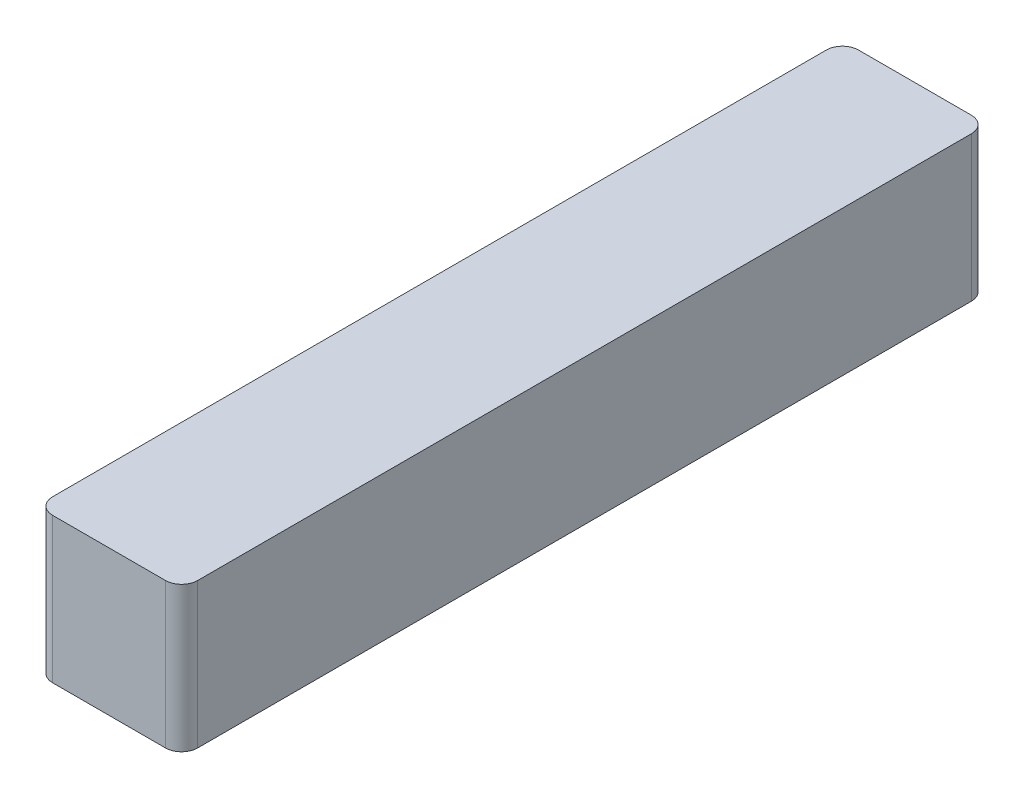
ISO-10303-21;
HEADER;
FILE_DESCRIPTION(('STEP AP214'),'2;1');
FILE_NAME('part.step','',(''),(''),'','','');
FILE_SCHEMA(('AUTOMOTIVE_DESIGN { 1 0 10303 214 1 1 1 1 }'));
ENDSEC;
DATA;
#1=APPLICATION_CONTEXT('core data for automotive mechanical design processes');
#2=APPLICATION_PROTOCOL_DEFINITION('international standard','automotive_design',2000,#1);
#3=PRODUCT_CONTEXT('',#1,'mechanical');
#4=PRODUCT('Part','Part','',(#3));
#5=PRODUCT_RELATED_PRODUCT_CATEGORY('part','',(#4));
#6=PRODUCT_DEFINITION_FORMATION('','',#4);
#7=PRODUCT_DEFINITION_CONTEXT('part definition',#1,'design');
#8=PRODUCT_DEFINITION('design','',#6,#7);
#9=PRODUCT_DEFINITION_SHAPE('','',#8);
#10=(LENGTH_UNIT() NAMED_UNIT(*) SI_UNIT(.MILLI.,.METRE.));
#11=(NAMED_UNIT(*) PLANE_ANGLE_UNIT() SI_UNIT($,.RADIAN.));
#12=(NAMED_UNIT(*) SI_UNIT($,.STERADIAN.) SOLID_ANGLE_UNIT());
#13=UNCERTAINTY_MEASURE_WITH_UNIT(LENGTH_MEASURE(1.E-05),#10,'distance_accuracy_value','');
#14=(GEOMETRIC_REPRESENTATION_CONTEXT(3) GLOBAL_UNCERTAINTY_ASSIGNED_CONTEXT((#13)) GLOBAL_UNIT_ASSIGNED_CONTEXT((#10,
#11,#12)) REPRESENTATION_CONTEXT('',''));
#15=CARTESIAN_POINT('',(0.,0.,0.));
#16=DIRECTION('',(0.,0.,1.));
#17=DIRECTION('',(1.,0.,0.));
#18=AXIS2_PLACEMENT_3D('',#15,#16,#17);
#19=CARTESIAN_POINT('',(1.143,1.143,12.7));
#20=DIRECTION('',(-1.,0.,0.));
#21=DIRECTION('',(0.,-1.,0.));
#22=AXIS2_PLACEMENT_3D('',#19,#20,#21);
#23=PLANE('',#22);
#24=DIRECTION('',(0.,0.,-1.));
#25=VECTOR('',#24,1.);
#26=CARTESIAN_POINT('',(1.143,-1.143,12.7));
#27=LINE('',#26,#25);
#28=CARTESIAN_POINT('',(1.143,-1.143,12.446));
#29=VERTEX_POINT('',#28);
#30=CARTESIAN_POINT('',(1.143,-1.143,0.254000000000001));
#31=VERTEX_POINT('',#30);
#32=EDGE_CURVE('E121',#29,#31,#27,.T.);
#33=ORIENTED_EDGE('',*,*,#32,.T.);
#34=DIRECTION('',(0.,1.,0.));
#35=VECTOR('',#34,1.);
#36=CARTESIAN_POINT('',(1.143,1.143,0.254000000000001));
#37=LINE('',#36,#35);
#38=CARTESIAN_POINT('',(1.143,1.143,0.254000000000001));
#39=VERTEX_POINT('',#38);
#40=EDGE_CURVE('E147',#31,#39,#37,.T.);
#41=ORIENTED_EDGE('',*,*,#40,.T.);
#42=DIRECTION('',(0.,0.,-1.));
#43=VECTOR('',#42,1.);
#44=CARTESIAN_POINT('',(1.143,1.143,12.7));
#45=LINE('',#44,#43);
#46=CARTESIAN_POINT('',(1.143,1.143,12.446));
#47=VERTEX_POINT('',#46);
#48=EDGE_CURVE('E125',#47,#39,#45,.T.);
#49=ORIENTED_EDGE('',*,*,#48,.F.);
#50=DIRECTION('',(0.,1.,0.));
#51=VECTOR('',#50,1.);
#52=CARTESIAN_POINT('',(1.143,-1.143,12.446));
#53=LINE('',#52,#51);
#54=EDGE_CURVE('E145',#47,#29,#53,.F.);
#55=ORIENTED_EDGE('',*,*,#54,.T.);
#56=EDGE_LOOP('',(#33,#41,#49,#55));
#57=FACE_BOUND('',#56,.T.);
#58=ADVANCED_FACE('F33',(#57),#23,.F.);
#59=CARTESIAN_POINT('',(-1.143,1.143,12.7));
#60=DIRECTION('',(0.,-1.,0.));
#61=DIRECTION('',(0.,0.,-1.));
#62=AXIS2_PLACEMENT_3D('',#59,#60,#61);
#63=PLANE('',#62);
#64=DIRECTION('',(-1.,0.,0.));
#65=VECTOR('',#64,1.);
#66=CARTESIAN_POINT('',(-1.143,1.143,0.));
#67=LINE('',#66,#65);
#68=CARTESIAN_POINT('',(0.889,1.143,0.));
#69=VERTEX_POINT('',#68);
#70=CARTESIAN_POINT('',(-0.889,1.143,0.));
#71=VERTEX_POINT('',#70);
#72=EDGE_CURVE('E157',#69,#71,#67,.T.);
#73=ORIENTED_EDGE('',*,*,#72,.T.);
#74=CARTESIAN_POINT('',(-0.889,1.143,0.254000000000001));
#75=DIRECTION('',(0.,-1.,0.));
#76=DIRECTION('',(0.,0.,-1.));
#77=AXIS2_PLACEMENT_3D('',#74,#75,#76);
#78=CIRCLE('',#77,0.254);
#79=CARTESIAN_POINT('',(-1.143,1.143,0.254000000000001));
#80=VERTEX_POINT('',#79);
#81=EDGE_CURVE('E143',#71,#80,#78,.F.);
#82=ORIENTED_EDGE('',*,*,#81,.T.);
#83=DIRECTION('',(0.,0.,-1.));
#84=VECTOR('',#83,1.);
#85=CARTESIAN_POINT('',(-1.143,1.143,12.7));
#86=LINE('',#85,#84);
#87=CARTESIAN_POINT('',(-1.143,1.143,12.446));
#88=VERTEX_POINT('',#87);
#89=EDGE_CURVE('E120',#88,#80,#86,.T.);
#90=ORIENTED_EDGE('',*,*,#89,.F.);
#91=CARTESIAN_POINT('',(-0.889,1.143,12.446));
#92=DIRECTION('',(0.,-1.,0.));
#93=DIRECTION('',(0.,0.,-1.));
#94=AXIS2_PLACEMENT_3D('',#91,#92,#93);
#95=CIRCLE('',#94,0.254);
#96=CARTESIAN_POINT('',(-0.889,1.143,12.7));
#97=VERTEX_POINT('',#96);
#98=EDGE_CURVE('E124',#88,#97,#95,.F.);
#99=ORIENTED_EDGE('',*,*,#98,.T.);
#100=DIRECTION('',(-1.,0.,0.));
#101=VECTOR('',#100,1.);
#102=CARTESIAN_POINT('',(-1.143,1.143,12.7));
#103=LINE('',#102,#101);
#104=CARTESIAN_POINT('',(0.889,1.143,12.7));
#105=VERTEX_POINT('',#104);
#106=EDGE_CURVE('E152',#105,#97,#103,.T.);
#107=ORIENTED_EDGE('',*,*,#106,.F.);
#108=CARTESIAN_POINT('',(0.888999999999999,1.143,12.446));
#109=DIRECTION('',(0.,-1.,0.));
#110=DIRECTION('',(0.,0.,-1.));
#111=AXIS2_PLACEMENT_3D('',#108,#109,#110);
#112=CIRCLE('',#111,0.254);
#113=EDGE_CURVE('E56',#105,#47,#112,.F.);
#114=ORIENTED_EDGE('',*,*,#113,.T.);
#115=ORIENTED_EDGE('',*,*,#48,.T.);
#116=CARTESIAN_POINT('',(0.888999999999999,1.143,0.254000000000001));
#117=DIRECTION('',(0.,-1.,0.));
#118=DIRECTION('',(0.,0.,-1.));
#119=AXIS2_PLACEMENT_3D('',#116,#117,#118);
#120=CIRCLE('',#119,0.254);
#121=EDGE_CURVE('E48',#39,#69,#120,.F.);
#122=ORIENTED_EDGE('',*,*,#121,.T.);
#123=EDGE_LOOP('',(#73,#82,#90,#99,#107,#114,#115,#122));
#124=FACE_BOUND('',#123,.T.);
#125=ADVANCED_FACE('F186',(#124),#63,.F.);
#126=CARTESIAN_POINT('',(-1.143,1.143,12.7));
#127=DIRECTION('',(1.,0.,0.));
#128=DIRECTION('',(0.,1.,0.));
#129=AXIS2_PLACEMENT_3D('',#126,#127,#128);
#130=PLANE('',#129);
#131=ORIENTED_EDGE('',*,*,#89,.T.);
#132=DIRECTION('',(0.,-1.,0.));
#133=VECTOR('',#132,1.);
#134=CARTESIAN_POINT('',(-1.143,1.143,0.254000000000001));
#135=LINE('',#134,#133);
#136=CARTESIAN_POINT('',(-1.143,-1.143,0.254000000000001));
#137=VERTEX_POINT('',#136);
#138=EDGE_CURVE('E111',#80,#137,#135,.T.);
#139=ORIENTED_EDGE('',*,*,#138,.T.);
#140=DIRECTION('',(0.,0.,-1.));
#141=VECTOR('',#140,1.);
#142=CARTESIAN_POINT('',(-1.143,-1.143,12.7));
#143=LINE('',#142,#141);
#144=CARTESIAN_POINT('',(-1.143,-1.143,12.446));
#145=VERTEX_POINT('',#144);
#146=EDGE_CURVE('E103',#145,#137,#143,.T.);
#147=ORIENTED_EDGE('',*,*,#146,.F.);
#148=DIRECTION('',(0.,-1.,0.));
#149=VECTOR('',#148,1.);
#150=CARTESIAN_POINT('',(-1.143,1.143,12.446));
#151=LINE('',#150,#149);
#152=EDGE_CURVE('E117',#145,#88,#151,.F.);
#153=ORIENTED_EDGE('',*,*,#152,.T.);
#154=EDGE_LOOP('',(#131,#139,#147,#153));
#155=FACE_BOUND('',#154,.T.);
#156=ADVANCED_FACE('F116',(#155),#130,.F.);
#157=CARTESIAN_POINT('',(-1.143,-1.143,12.7));
#158=DIRECTION('',(0.,1.,0.));
#159=DIRECTION('',(0.,0.,1.));
#160=AXIS2_PLACEMENT_3D('',#157,#158,#159);
#161=PLANE('',#160);
#162=ORIENTED_EDGE('',*,*,#146,.T.);
#163=CARTESIAN_POINT('',(-0.889,-1.143,0.254000000000001));
#164=DIRECTION('',(0.,1.,0.));
#165=DIRECTION('',(0.,0.,1.));
#166=AXIS2_PLACEMENT_3D('',#163,#164,#165);
#167=CIRCLE('',#166,0.254);
#168=CARTESIAN_POINT('',(-0.889,-1.143,0.));
#169=VERTEX_POINT('',#168);
#170=EDGE_CURVE('E134',#137,#169,#167,.F.);
#171=ORIENTED_EDGE('',*,*,#170,.T.);
#172=DIRECTION('',(1.,0.,0.));
#173=VECTOR('',#172,1.);
#174=CARTESIAN_POINT('',(-1.143,-1.143,0.));
#175=LINE('',#174,#173);
#176=CARTESIAN_POINT('',(0.889,-1.143,0.));
#177=VERTEX_POINT('',#176);
#178=EDGE_CURVE('E153',#169,#177,#175,.T.);
#179=ORIENTED_EDGE('',*,*,#178,.T.);
#180=CARTESIAN_POINT('',(0.889,-1.143,0.254000000000001));
#181=DIRECTION('',(0.,1.,0.));
#182=DIRECTION('',(0.,0.,1.));
#183=AXIS2_PLACEMENT_3D('',#180,#181,#182);
#184=CIRCLE('',#183,0.254);
#185=EDGE_CURVE('E132',#177,#31,#184,.F.);
#186=ORIENTED_EDGE('',*,*,#185,.T.);
#187=ORIENTED_EDGE('',*,*,#32,.F.);
#188=CARTESIAN_POINT('',(0.889,-1.143,12.446));
#189=DIRECTION('',(0.,1.,0.));
#190=DIRECTION('',(0.,0.,1.));
#191=AXIS2_PLACEMENT_3D('',#188,#189,#190);
#192=CIRCLE('',#191,0.254);
#193=CARTESIAN_POINT('',(0.889,-1.143,12.7));
#194=VERTEX_POINT('',#193);
#195=EDGE_CURVE('E110',#29,#194,#192,.F.);
#196=ORIENTED_EDGE('',*,*,#195,.T.);
#197=DIRECTION('',(1.,0.,0.));
#198=VECTOR('',#197,1.);
#199=CARTESIAN_POINT('',(-1.143,-1.143,12.7));
#200=LINE('',#199,#198);
#201=CARTESIAN_POINT('',(-0.889,-1.143,12.7));
#202=VERTEX_POINT('',#201);
#203=EDGE_CURVE('E105',#202,#194,#200,.T.);
#204=ORIENTED_EDGE('',*,*,#203,.F.);
#205=CARTESIAN_POINT('',(-0.889,-1.143,12.446));
#206=DIRECTION('',(0.,1.,0.));
#207=DIRECTION('',(0.,0.,1.));
#208=AXIS2_PLACEMENT_3D('',#205,#206,#207);
#209=CIRCLE('',#208,0.254);
#210=EDGE_CURVE('E100',#202,#145,#209,.F.);
#211=ORIENTED_EDGE('',*,*,#210,.T.);
#212=EDGE_LOOP('',(#162,#171,#179,#186,#187,#196,#204,#211));
#213=FACE_BOUND('',#212,.T.);
#214=ADVANCED_FACE('F102',(#213),#161,.F.);
#215=CARTESIAN_POINT('',(0.,0.,12.7));
#216=DIRECTION('',(0.,0.,1.));
#217=DIRECTION('',(1.,0.,0.));
#218=AXIS2_PLACEMENT_3D('',#215,#216,#217);
#219=PLANE('',#218);
#220=ORIENTED_EDGE('',*,*,#203,.T.);
#221=DIRECTION('',(0.,1.,0.));
#222=VECTOR('',#221,1.);
#223=CARTESIAN_POINT('',(0.888999999999999,1.143,12.7));
#224=LINE('',#223,#222);
#225=EDGE_CURVE('E11',#194,#105,#224,.T.);
#226=ORIENTED_EDGE('',*,*,#225,.T.);
#227=ORIENTED_EDGE('',*,*,#106,.T.);
#228=DIRECTION('',(0.,-1.,0.));
#229=VECTOR('',#228,1.);
#230=CARTESIAN_POINT('',(-0.889,-1.143,12.7));
#231=LINE('',#230,#229);
#232=EDGE_CURVE('E41',#97,#202,#231,.T.);
#233=ORIENTED_EDGE('',*,*,#232,.T.);
#234=EDGE_LOOP('',(#220,#226,#227,#233));
#235=FACE_BOUND('',#234,.T.);
#236=ADVANCED_FACE('F150',(#235),#219,.T.);
#237=CARTESIAN_POINT('',(0.,0.,0.));
#238=DIRECTION('',(0.,0.,1.));
#239=DIRECTION('',(1.,0.,0.));
#240=AXIS2_PLACEMENT_3D('',#237,#238,#239);
#241=PLANE('',#240);
#242=ORIENTED_EDGE('',*,*,#178,.F.);
#243=DIRECTION('',(0.,-1.,0.));
#244=VECTOR('',#243,1.);
#245=CARTESIAN_POINT('',(-0.889,0.,0.));
#246=LINE('',#245,#244);
#247=EDGE_CURVE('E138',#169,#71,#246,.F.);
#248=ORIENTED_EDGE('',*,*,#247,.T.);
#249=ORIENTED_EDGE('',*,*,#72,.F.);
#250=DIRECTION('',(0.,1.,0.));
#251=VECTOR('',#250,1.);
#252=CARTESIAN_POINT('',(0.889,0.,0.));
#253=LINE('',#252,#251);
#254=EDGE_CURVE('E136',#69,#177,#253,.F.);
#255=ORIENTED_EDGE('',*,*,#254,.T.);
#256=EDGE_LOOP('',(#242,#248,#249,#255));
#257=FACE_BOUND('',#256,.T.);
#258=ADVANCED_FACE('F170',(#257),#241,.F.);
#259=CARTESIAN_POINT('',(-0.889,1.143,0.254000000000001));
#260=DIRECTION('',(0.,-1.,0.));
#261=DIRECTION('',(1.,0.,0.));
#262=AXIS2_PLACEMENT_3D('',#259,#260,#261);
#263=CYLINDRICAL_SURFACE('',#262,0.254);
#264=ORIENTED_EDGE('',*,*,#81,.F.);
#265=ORIENTED_EDGE('',*,*,#247,.F.);
#266=ORIENTED_EDGE('',*,*,#170,.F.);
#267=ORIENTED_EDGE('',*,*,#138,.F.);
#268=EDGE_LOOP('',(#264,#265,#266,#267));
#269=FACE_BOUND('',#268,.T.);
#270=ADVANCED_FACE('F165',(#269),#263,.T.);
#271=CARTESIAN_POINT('',(0.888999999999999,1.143,0.254000000000001));
#272=DIRECTION('',(0.,1.,0.));
#273=DIRECTION('',(-1.,0.,0.));
#274=AXIS2_PLACEMENT_3D('',#271,#272,#273);
#275=CYLINDRICAL_SURFACE('',#274,0.254);
#276=ORIENTED_EDGE('',*,*,#185,.F.);
#277=ORIENTED_EDGE('',*,*,#254,.F.);
#278=ORIENTED_EDGE('',*,*,#121,.F.);
#279=ORIENTED_EDGE('',*,*,#40,.F.);
#280=EDGE_LOOP('',(#276,#277,#278,#279));
#281=FACE_BOUND('',#280,.T.);
#282=ADVANCED_FACE('F172',(#281),#275,.T.);
#283=CARTESIAN_POINT('',(0.889,0.,12.446));
#284=DIRECTION('',(0.,-1.,0.));
#285=DIRECTION('',(1.,0.,0.));
#286=AXIS2_PLACEMENT_3D('',#283,#284,#285);
#287=CYLINDRICAL_SURFACE('',#286,0.254);
#288=ORIENTED_EDGE('',*,*,#195,.F.);
#289=ORIENTED_EDGE('',*,*,#54,.F.);
#290=ORIENTED_EDGE('',*,*,#113,.F.);
#291=ORIENTED_EDGE('',*,*,#225,.F.);
#292=EDGE_LOOP('',(#288,#289,#290,#291));
#293=FACE_BOUND('',#292,.T.);
#294=ADVANCED_FACE('F178',(#293),#287,.T.);
#295=CARTESIAN_POINT('',(-0.889,0.,12.446));
#296=DIRECTION('',(0.,1.,0.));
#297=DIRECTION('',(-1.,0.,0.));
#298=AXIS2_PLACEMENT_3D('',#295,#296,#297);
#299=CYLINDRICAL_SURFACE('',#298,0.254);
#300=ORIENTED_EDGE('',*,*,#98,.F.);
#301=ORIENTED_EDGE('',*,*,#152,.F.);
#302=ORIENTED_EDGE('',*,*,#210,.F.);
#303=ORIENTED_EDGE('',*,*,#232,.F.);
#304=EDGE_LOOP('',(#300,#301,#302,#303));
#305=FACE_BOUND('',#304,.T.);
#306=ADVANCED_FACE('F35',(#305),#299,.T.);
#307=CLOSED_SHELL('',(#58,#125,#156,#214,#236,#258,#270,#282,#294,#306));
#308=MANIFOLD_SOLID_BREP('B2',#307);
#309=ADVANCED_BREP_SHAPE_REPRESENTATION('',(#18,#308),#14);
#310=SHAPE_DEFINITION_REPRESENTATION(#9,#309);
ENDSEC;
END-ISO-10303-21;
